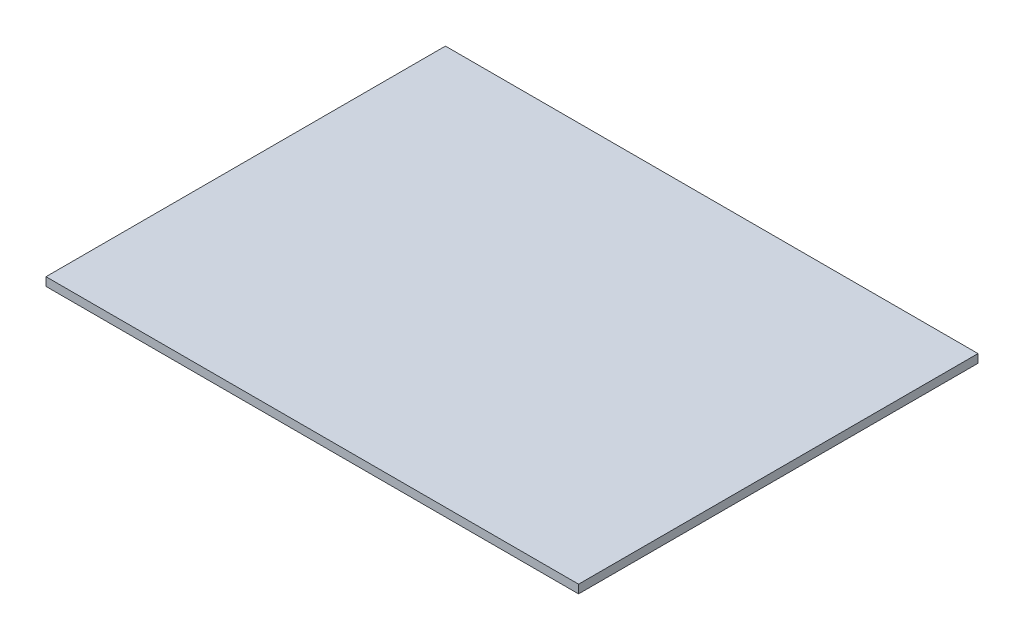
ISO-10303-21;
HEADER;
FILE_DESCRIPTION(('STEP AP214'),'2;1');
FILE_NAME('part.step','',(''),(''),'','','');
FILE_SCHEMA(('AUTOMOTIVE_DESIGN { 1 0 10303 214 1 1 1 1 }'));
ENDSEC;
DATA;
#1=APPLICATION_CONTEXT('core data for automotive mechanical design processes');
#2=APPLICATION_PROTOCOL_DEFINITION('international standard','automotive_design',2000,#1);
#3=PRODUCT_CONTEXT('',#1,'mechanical');
#4=PRODUCT('Part','Part','',(#3));
#5=PRODUCT_RELATED_PRODUCT_CATEGORY('part','',(#4));
#6=PRODUCT_DEFINITION_FORMATION('','',#4);
#7=PRODUCT_DEFINITION_CONTEXT('part definition',#1,'design');
#8=PRODUCT_DEFINITION('design','',#6,#7);
#9=PRODUCT_DEFINITION_SHAPE('','',#8);
#10=(LENGTH_UNIT() NAMED_UNIT(*) SI_UNIT(.MILLI.,.METRE.));
#11=(NAMED_UNIT(*) PLANE_ANGLE_UNIT() SI_UNIT($,.RADIAN.));
#12=(NAMED_UNIT(*) SI_UNIT($,.STERADIAN.) SOLID_ANGLE_UNIT());
#13=UNCERTAINTY_MEASURE_WITH_UNIT(LENGTH_MEASURE(1.E-05),#10,'distance_accuracy_value','');
#14=(GEOMETRIC_REPRESENTATION_CONTEXT(3) GLOBAL_UNCERTAINTY_ASSIGNED_CONTEXT((#13)) GLOBAL_UNIT_ASSIGNED_CONTEXT((#10,
#11,#12)) REPRESENTATION_CONTEXT('',''));
#15=CARTESIAN_POINT('',(0.,0.,0.));
#16=DIRECTION('',(0.,0.,1.));
#17=DIRECTION('',(1.,0.,0.));
#18=AXIS2_PLACEMENT_3D('',#15,#16,#17);
#19=CARTESIAN_POINT('',(0.,1.5875,0.));
#20=DIRECTION('',(1.,0.,0.));
#21=DIRECTION('',(0.,0.,-1.));
#22=AXIS2_PLACEMENT_3D('',#19,#20,#21);
#23=PLANE('',#22);
#24=DIRECTION('',(0.,0.,1.));
#25=VECTOR('',#24,1.);
#26=CARTESIAN_POINT('',(0.,0.,0.));
#27=LINE('',#26,#25);
#28=CARTESIAN_POINT('',(0.,0.,-75.));
#29=VERTEX_POINT('',#28);
#30=CARTESIAN_POINT('',(0.,0.,0.));
#31=VERTEX_POINT('',#30);
#32=EDGE_CURVE('E96',#29,#31,#27,.T.);
#33=ORIENTED_EDGE('',*,*,#32,.T.);
#34=DIRECTION('',(0.,-1.,0.));
#35=VECTOR('',#34,1.);
#36=CARTESIAN_POINT('',(0.,1.5875,0.));
#37=LINE('',#36,#35);
#38=CARTESIAN_POINT('',(0.,1.5875,0.));
#39=VERTEX_POINT('',#38);
#40=EDGE_CURVE('E11',#39,#31,#37,.T.);
#41=ORIENTED_EDGE('',*,*,#40,.F.);
#42=DIRECTION('',(0.,0.,1.));
#43=VECTOR('',#42,1.);
#44=CARTESIAN_POINT('',(0.,1.5875,0.));
#45=LINE('',#44,#43);
#46=CARTESIAN_POINT('',(0.,1.5875,-75.));
#47=VERTEX_POINT('',#46);
#48=EDGE_CURVE('E84',#47,#39,#45,.T.);
#49=ORIENTED_EDGE('',*,*,#48,.F.);
#50=DIRECTION('',(0.,-1.,0.));
#51=VECTOR('',#50,1.);
#52=CARTESIAN_POINT('',(0.,1.5875,-75.));
#53=LINE('',#52,#51);
#54=EDGE_CURVE('E92',#47,#29,#53,.T.);
#55=ORIENTED_EDGE('',*,*,#54,.T.);
#56=EDGE_LOOP('',(#33,#41,#49,#55));
#57=FACE_BOUND('',#56,.T.);
#58=ADVANCED_FACE('F33',(#57),#23,.F.);
#59=CARTESIAN_POINT('',(0.,1.5875,0.));
#60=DIRECTION('',(0.,0.,-1.));
#61=DIRECTION('',(-1.,0.,0.));
#62=AXIS2_PLACEMENT_3D('',#59,#60,#61);
#63=PLANE('',#62);
#64=DIRECTION('',(1.,0.,0.));
#65=VECTOR('',#64,1.);
#66=CARTESIAN_POINT('',(0.,0.,0.));
#67=LINE('',#66,#65);
#68=CARTESIAN_POINT('',(100.,0.,0.));
#69=VERTEX_POINT('',#68);
#70=EDGE_CURVE('E88',#31,#69,#67,.T.);
#71=ORIENTED_EDGE('',*,*,#70,.T.);
#72=DIRECTION('',(0.,-1.,0.));
#73=VECTOR('',#72,1.);
#74=CARTESIAN_POINT('',(100.,1.5875,0.));
#75=LINE('',#74,#73);
#76=CARTESIAN_POINT('',(100.,1.5875,0.));
#77=VERTEX_POINT('',#76);
#78=EDGE_CURVE('E41',#77,#69,#75,.T.);
#79=ORIENTED_EDGE('',*,*,#78,.F.);
#80=DIRECTION('',(1.,0.,0.));
#81=VECTOR('',#80,1.);
#82=CARTESIAN_POINT('',(0.,1.5875,0.));
#83=LINE('',#82,#81);
#84=EDGE_CURVE('E79',#39,#77,#83,.T.);
#85=ORIENTED_EDGE('',*,*,#84,.F.);
#86=ORIENTED_EDGE('',*,*,#40,.T.);
#87=EDGE_LOOP('',(#71,#79,#85,#86));
#88=FACE_BOUND('',#87,.T.);
#89=ADVANCED_FACE('F87',(#88),#63,.F.);
#90=CARTESIAN_POINT('',(100.,1.5875,0.));
#91=DIRECTION('',(-1.,0.,0.));
#92=DIRECTION('',(0.,0.,1.));
#93=AXIS2_PLACEMENT_3D('',#90,#91,#92);
#94=PLANE('',#93);
#95=DIRECTION('',(0.,0.,-1.));
#96=VECTOR('',#95,1.);
#97=CARTESIAN_POINT('',(100.,0.,0.));
#98=LINE('',#97,#96);
#99=CARTESIAN_POINT('',(100.,0.,-75.));
#100=VERTEX_POINT('',#99);
#101=EDGE_CURVE('E66',#69,#100,#98,.T.);
#102=ORIENTED_EDGE('',*,*,#101,.T.);
#103=DIRECTION('',(0.,-1.,0.));
#104=VECTOR('',#103,1.);
#105=CARTESIAN_POINT('',(100.,1.5875,-75.));
#106=LINE('',#105,#104);
#107=CARTESIAN_POINT('',(100.,1.5875,-75.));
#108=VERTEX_POINT('',#107);
#109=EDGE_CURVE('E89',#108,#100,#106,.T.);
#110=ORIENTED_EDGE('',*,*,#109,.F.);
#111=DIRECTION('',(0.,0.,-1.));
#112=VECTOR('',#111,1.);
#113=CARTESIAN_POINT('',(100.,1.5875,0.));
#114=LINE('',#113,#112);
#115=EDGE_CURVE('E82',#77,#108,#114,.T.);
#116=ORIENTED_EDGE('',*,*,#115,.F.);
#117=ORIENTED_EDGE('',*,*,#78,.T.);
#118=EDGE_LOOP('',(#102,#110,#116,#117));
#119=FACE_BOUND('',#118,.T.);
#120=ADVANCED_FACE('F90',(#119),#94,.F.);
#121=CARTESIAN_POINT('',(0.,1.5875,-75.));
#122=DIRECTION('',(0.,0.,1.));
#123=DIRECTION('',(1.,0.,0.));
#124=AXIS2_PLACEMENT_3D('',#121,#122,#123);
#125=PLANE('',#124);
#126=DIRECTION('',(-1.,0.,0.));
#127=VECTOR('',#126,1.);
#128=CARTESIAN_POINT('',(0.,0.,-75.));
#129=LINE('',#128,#127);
#130=EDGE_CURVE('E72',#100,#29,#129,.T.);
#131=ORIENTED_EDGE('',*,*,#130,.T.);
#132=ORIENTED_EDGE('',*,*,#54,.F.);
#133=DIRECTION('',(-1.,0.,0.));
#134=VECTOR('',#133,1.);
#135=CARTESIAN_POINT('',(0.,1.5875,-75.));
#136=LINE('',#135,#134);
#137=EDGE_CURVE('E49',#108,#47,#136,.T.);
#138=ORIENTED_EDGE('',*,*,#137,.F.);
#139=ORIENTED_EDGE('',*,*,#109,.T.);
#140=EDGE_LOOP('',(#131,#132,#138,#139));
#141=FACE_BOUND('',#140,.T.);
#142=ADVANCED_FACE('F103',(#141),#125,.F.);
#143=CARTESIAN_POINT('',(0.,1.5875,-75.));
#144=DIRECTION('',(0.,-1.,0.));
#145=DIRECTION('',(0.,0.,-1.));
#146=AXIS2_PLACEMENT_3D('',#143,#144,#145);
#147=PLANE('',#146);
#148=ORIENTED_EDGE('',*,*,#48,.T.);
#149=ORIENTED_EDGE('',*,*,#84,.T.);
#150=ORIENTED_EDGE('',*,*,#115,.T.);
#151=ORIENTED_EDGE('',*,*,#137,.T.);
#152=EDGE_LOOP('',(#148,#149,#150,#151));
#153=FACE_BOUND('',#152,.T.);
#154=ADVANCED_FACE('F80',(#153),#147,.F.);
#155=CARTESIAN_POINT('',(0.,0.,-75.));
#156=DIRECTION('',(0.,-1.,0.));
#157=DIRECTION('',(0.,0.,-1.));
#158=AXIS2_PLACEMENT_3D('',#155,#156,#157);
#159=PLANE('',#158);
#160=ORIENTED_EDGE('',*,*,#32,.F.);
#161=ORIENTED_EDGE('',*,*,#130,.F.);
#162=ORIENTED_EDGE('',*,*,#101,.F.);
#163=ORIENTED_EDGE('',*,*,#70,.F.);
#164=EDGE_LOOP('',(#160,#161,#162,#163));
#165=FACE_BOUND('',#164,.T.);
#166=ADVANCED_FACE('F106',(#165),#159,.T.);
#167=CLOSED_SHELL('',(#58,#89,#120,#142,#154,#166));
#168=MANIFOLD_SOLID_BREP('B2',#167);
#169=ADVANCED_BREP_SHAPE_REPRESENTATION('',(#18,#168),#14);
#170=SHAPE_DEFINITION_REPRESENTATION(#9,#169);
ENDSEC;
END-ISO-10303-21;
